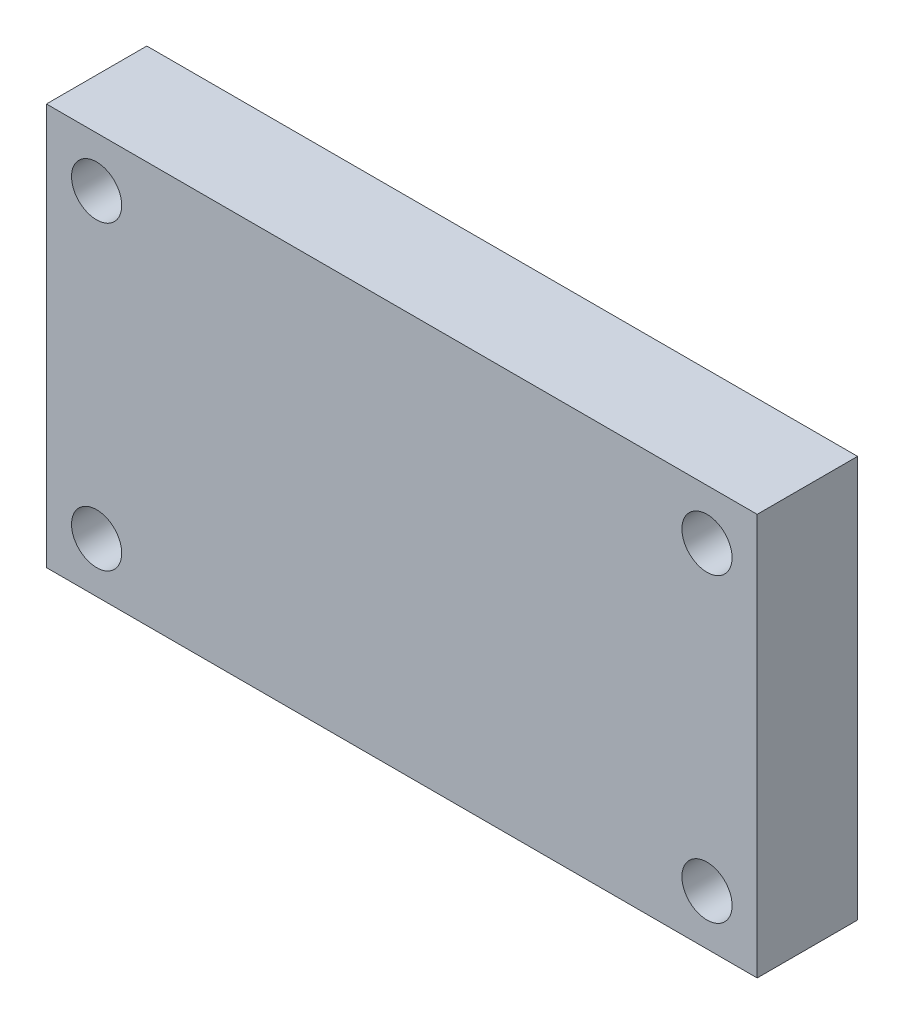
ISO-10303-21;
HEADER;
FILE_DESCRIPTION(('STEP AP214'),'2;1');
FILE_NAME('part.step','',(''),(''),'','','');
FILE_SCHEMA(('AUTOMOTIVE_DESIGN { 1 0 10303 214 1 1 1 1 }'));
ENDSEC;
DATA;
#1=APPLICATION_CONTEXT('core data for automotive mechanical design processes');
#2=APPLICATION_PROTOCOL_DEFINITION('international standard','automotive_design',2000,#1);
#3=PRODUCT_CONTEXT('',#1,'mechanical');
#4=PRODUCT('Part','Part','',(#3));
#5=PRODUCT_RELATED_PRODUCT_CATEGORY('part','',(#4));
#6=PRODUCT_DEFINITION_FORMATION('','',#4);
#7=PRODUCT_DEFINITION_CONTEXT('part definition',#1,'design');
#8=PRODUCT_DEFINITION('design','',#6,#7);
#9=PRODUCT_DEFINITION_SHAPE('','',#8);
#10=(LENGTH_UNIT() NAMED_UNIT(*) SI_UNIT(.MILLI.,.METRE.));
#11=(NAMED_UNIT(*) PLANE_ANGLE_UNIT() SI_UNIT($,.RADIAN.));
#12=(NAMED_UNIT(*) SI_UNIT($,.STERADIAN.) SOLID_ANGLE_UNIT());
#13=UNCERTAINTY_MEASURE_WITH_UNIT(LENGTH_MEASURE(1.E-05),#10,'distance_accuracy_value','');
#14=(GEOMETRIC_REPRESENTATION_CONTEXT(3) GLOBAL_UNCERTAINTY_ASSIGNED_CONTEXT((#13)) GLOBAL_UNIT_ASSIGNED_CONTEXT((#10,
#11,#12)) REPRESENTATION_CONTEXT('',''));
#15=CARTESIAN_POINT('',(0.,0.,0.));
#16=DIRECTION('',(0.,0.,1.));
#17=DIRECTION('',(1.,0.,0.));
#18=AXIS2_PLACEMENT_3D('',#15,#16,#17);
#19=CARTESIAN_POINT('',(0.,-20.,5.));
#20=DIRECTION('',(0.,1.,0.));
#21=DIRECTION('',(0.,0.,1.));
#22=AXIS2_PLACEMENT_3D('',#19,#20,#21);
#23=PLANE('',#22);
#24=DIRECTION('',(1.,0.,0.));
#25=VECTOR('',#24,1.);
#26=CARTESIAN_POINT('',(0.,-20.,0.));
#27=LINE('',#26,#25);
#28=CARTESIAN_POINT('',(0.,-20.,0.));
#29=VERTEX_POINT('',#28);
#30=CARTESIAN_POINT('',(35.4,-20.,0.));
#31=VERTEX_POINT('',#30);
#32=EDGE_CURVE('E108',#29,#31,#27,.T.);
#33=ORIENTED_EDGE('',*,*,#32,.T.);
#34=DIRECTION('',(0.,0.,-1.));
#35=VECTOR('',#34,1.);
#36=CARTESIAN_POINT('',(35.4,-20.,5.));
#37=LINE('',#36,#35);
#38=CARTESIAN_POINT('',(35.4,-20.,5.));
#39=VERTEX_POINT('',#38);
#40=EDGE_CURVE('E11',#39,#31,#37,.T.);
#41=ORIENTED_EDGE('',*,*,#40,.F.);
#42=DIRECTION('',(1.,0.,0.));
#43=VECTOR('',#42,1.);
#44=CARTESIAN_POINT('',(0.,-20.,5.));
#45=LINE('',#44,#43);
#46=CARTESIAN_POINT('',(0.,-20.,5.));
#47=VERTEX_POINT('',#46);
#48=EDGE_CURVE('E72',#47,#39,#45,.T.);
#49=ORIENTED_EDGE('',*,*,#48,.F.);
#50=DIRECTION('',(0.,0.,-1.));
#51=VECTOR('',#50,1.);
#52=CARTESIAN_POINT('',(0.,-20.,5.));
#53=LINE('',#52,#51);
#54=EDGE_CURVE('E107',#47,#29,#53,.T.);
#55=ORIENTED_EDGE('',*,*,#54,.T.);
#56=EDGE_LOOP('',(#33,#41,#49,#55));
#57=FACE_BOUND('',#56,.T.);
#58=ADVANCED_FACE('F33',(#57),#23,.F.);
#59=CARTESIAN_POINT('',(35.4,0.,5.));
#60=DIRECTION('',(1.,0.,0.));
#61=DIRECTION('',(0.,0.,-1.));
#62=AXIS2_PLACEMENT_3D('',#59,#60,#61);
#63=PLANE('',#62);
#64=DIRECTION('',(0.,-1.,0.));
#65=VECTOR('',#64,1.);
#66=CARTESIAN_POINT('',(35.4,0.,0.));
#67=LINE('',#66,#65);
#68=CARTESIAN_POINT('',(35.4,0.,0.));
#69=VERTEX_POINT('',#68);
#70=EDGE_CURVE('E81',#69,#31,#67,.T.);
#71=ORIENTED_EDGE('',*,*,#70,.F.);
#72=DIRECTION('',(0.,0.,-1.));
#73=VECTOR('',#72,1.);
#74=CARTESIAN_POINT('',(35.4,0.,5.));
#75=LINE('',#74,#73);
#76=CARTESIAN_POINT('',(35.4,0.,5.));
#77=VERTEX_POINT('',#76);
#78=EDGE_CURVE('E41',#77,#69,#75,.T.);
#79=ORIENTED_EDGE('',*,*,#78,.F.);
#80=DIRECTION('',(0.,-1.,0.));
#81=VECTOR('',#80,1.);
#82=CARTESIAN_POINT('',(35.4,0.,5.));
#83=LINE('',#82,#81);
#84=EDGE_CURVE('E79',#77,#39,#83,.T.);
#85=ORIENTED_EDGE('',*,*,#84,.T.);
#86=ORIENTED_EDGE('',*,*,#40,.T.);
#87=EDGE_LOOP('',(#71,#79,#85,#86));
#88=FACE_BOUND('',#87,.T.);
#89=ADVANCED_FACE('F78',(#88),#63,.T.);
#90=CARTESIAN_POINT('',(0.,0.,5.));
#91=DIRECTION('',(0.,1.,0.));
#92=DIRECTION('',(0.,0.,1.));
#93=AXIS2_PLACEMENT_3D('',#90,#91,#92);
#94=PLANE('',#93);
#95=DIRECTION('',(1.,0.,0.));
#96=VECTOR('',#95,1.);
#97=CARTESIAN_POINT('',(0.,0.,0.));
#98=LINE('',#97,#96);
#99=CARTESIAN_POINT('',(0.,0.,0.));
#100=VERTEX_POINT('',#99);
#101=EDGE_CURVE('E112',#100,#69,#98,.T.);
#102=ORIENTED_EDGE('',*,*,#101,.F.);
#103=DIRECTION('',(0.,0.,-1.));
#104=VECTOR('',#103,1.);
#105=CARTESIAN_POINT('',(0.,0.,5.));
#106=LINE('',#105,#104);
#107=CARTESIAN_POINT('',(0.,0.,5.));
#108=VERTEX_POINT('',#107);
#109=EDGE_CURVE('E64',#108,#100,#106,.T.);
#110=ORIENTED_EDGE('',*,*,#109,.F.);
#111=DIRECTION('',(1.,0.,0.));
#112=VECTOR('',#111,1.);
#113=CARTESIAN_POINT('',(0.,0.,5.));
#114=LINE('',#113,#112);
#115=EDGE_CURVE('E88',#108,#77,#114,.T.);
#116=ORIENTED_EDGE('',*,*,#115,.T.);
#117=ORIENTED_EDGE('',*,*,#78,.T.);
#118=EDGE_LOOP('',(#102,#110,#116,#117));
#119=FACE_BOUND('',#118,.T.);
#120=ADVANCED_FACE('F90',(#119),#94,.T.);
#121=CARTESIAN_POINT('',(32.9,-2.5,5.));
#122=DIRECTION('',(0.,0.,-1.));
#123=DIRECTION('',(-1.,0.,0.));
#124=AXIS2_PLACEMENT_3D('',#121,#122,#123);
#125=CYLINDRICAL_SURFACE('',#124,1.25);
#126=CARTESIAN_POINT('',(32.9,-2.5,5.));
#127=DIRECTION('',(0.,0.,1.));
#128=DIRECTION('',(1.,0.,0.));
#129=AXIS2_PLACEMENT_3D('',#126,#127,#128);
#130=CIRCLE('',#129,1.25);
#131=CARTESIAN_POINT('',(34.15,-2.5,5.));
#132=VERTEX_POINT('',#131);
#133=EDGE_CURVE('E101',#132,#132,#130,.T.);
#134=ORIENTED_EDGE('',*,*,#133,.T.);
#135=EDGE_LOOP('',(#134));
#136=FACE_BOUND('',#135,.T.);
#137=CARTESIAN_POINT('',(32.9,-2.5,0.));
#138=DIRECTION('',(0.,0.,1.));
#139=DIRECTION('',(1.,0.,0.));
#140=AXIS2_PLACEMENT_3D('',#137,#138,#139);
#141=CIRCLE('',#140,1.25);
#142=CARTESIAN_POINT('',(34.15,-2.5,0.));
#143=VERTEX_POINT('',#142);
#144=EDGE_CURVE('E121',#143,#143,#141,.T.);
#145=ORIENTED_EDGE('',*,*,#144,.F.);
#146=EDGE_LOOP('',(#145));
#147=FACE_BOUND('',#146,.T.);
#148=ADVANCED_FACE('F163',(#136,#147),#125,.F.);
#149=CARTESIAN_POINT('',(2.5,-2.5,5.));
#150=DIRECTION('',(0.,0.,-1.));
#151=DIRECTION('',(-1.,0.,0.));
#152=AXIS2_PLACEMENT_3D('',#149,#150,#151);
#153=CYLINDRICAL_SURFACE('',#152,1.25);
#154=CARTESIAN_POINT('',(2.5,-2.5,5.));
#155=DIRECTION('',(0.,0.,1.));
#156=DIRECTION('',(1.,0.,0.));
#157=AXIS2_PLACEMENT_3D('',#154,#155,#156);
#158=CIRCLE('',#157,1.25);
#159=CARTESIAN_POINT('',(3.75,-2.5,5.));
#160=VERTEX_POINT('',#159);
#161=EDGE_CURVE('E98',#160,#160,#158,.T.);
#162=ORIENTED_EDGE('',*,*,#161,.T.);
#163=EDGE_LOOP('',(#162));
#164=FACE_BOUND('',#163,.T.);
#165=CARTESIAN_POINT('',(2.5,-2.5,0.));
#166=DIRECTION('',(0.,0.,1.));
#167=DIRECTION('',(1.,0.,0.));
#168=AXIS2_PLACEMENT_3D('',#165,#166,#167);
#169=CIRCLE('',#168,1.25);
#170=CARTESIAN_POINT('',(3.75,-2.5,0.));
#171=VERTEX_POINT('',#170);
#172=EDGE_CURVE('E118',#171,#171,#169,.T.);
#173=ORIENTED_EDGE('',*,*,#172,.F.);
#174=EDGE_LOOP('',(#173));
#175=FACE_BOUND('',#174,.T.);
#176=ADVANCED_FACE('F168',(#164,#175),#153,.F.);
#177=CARTESIAN_POINT('',(2.5,-17.5,5.));
#178=DIRECTION('',(0.,0.,-1.));
#179=DIRECTION('',(-1.,0.,0.));
#180=AXIS2_PLACEMENT_3D('',#177,#178,#179);
#181=CYLINDRICAL_SURFACE('',#180,1.25);
#182=CARTESIAN_POINT('',(2.5,-17.5,5.));
#183=DIRECTION('',(0.,0.,1.));
#184=DIRECTION('',(1.,0.,0.));
#185=AXIS2_PLACEMENT_3D('',#182,#183,#184);
#186=CIRCLE('',#185,1.25);
#187=CARTESIAN_POINT('',(3.75,-17.5,5.));
#188=VERTEX_POINT('',#187);
#189=EDGE_CURVE('E92',#188,#188,#186,.T.);
#190=ORIENTED_EDGE('',*,*,#189,.T.);
#191=EDGE_LOOP('',(#190));
#192=FACE_BOUND('',#191,.T.);
#193=CARTESIAN_POINT('',(2.5,-17.5,0.));
#194=DIRECTION('',(0.,0.,1.));
#195=DIRECTION('',(1.,0.,0.));
#196=AXIS2_PLACEMENT_3D('',#193,#194,#195);
#197=CIRCLE('',#196,1.25);
#198=CARTESIAN_POINT('',(3.75,-17.5,0.));
#199=VERTEX_POINT('',#198);
#200=EDGE_CURVE('E115',#199,#199,#197,.T.);
#201=ORIENTED_EDGE('',*,*,#200,.F.);
#202=EDGE_LOOP('',(#201));
#203=FACE_BOUND('',#202,.T.);
#204=ADVANCED_FACE('F153',(#192,#203),#181,.F.);
#205=CARTESIAN_POINT('',(0.,0.,5.));
#206=DIRECTION('',(1.,0.,0.));
#207=DIRECTION('',(0.,1.,0.));
#208=AXIS2_PLACEMENT_3D('',#205,#206,#207);
#209=PLANE('',#208);
#210=DIRECTION('',(0.,-1.,0.));
#211=VECTOR('',#210,1.);
#212=CARTESIAN_POINT('',(0.,0.,0.));
#213=LINE('',#212,#211);
#214=EDGE_CURVE('E67',#100,#29,#213,.T.);
#215=ORIENTED_EDGE('',*,*,#214,.T.);
#216=ORIENTED_EDGE('',*,*,#54,.F.);
#217=DIRECTION('',(0.,-1.,0.));
#218=VECTOR('',#217,1.);
#219=CARTESIAN_POINT('',(0.,0.,5.));
#220=LINE('',#219,#218);
#221=EDGE_CURVE('E49',#108,#47,#220,.T.);
#222=ORIENTED_EDGE('',*,*,#221,.F.);
#223=ORIENTED_EDGE('',*,*,#109,.T.);
#224=EDGE_LOOP('',(#215,#216,#222,#223));
#225=FACE_BOUND('',#224,.T.);
#226=ADVANCED_FACE('F145',(#225),#209,.F.);
#227=CARTESIAN_POINT('',(32.9,-17.5,5.));
#228=DIRECTION('',(0.,0.,-1.));
#229=DIRECTION('',(-1.,0.,0.));
#230=AXIS2_PLACEMENT_3D('',#227,#228,#229);
#231=CYLINDRICAL_SURFACE('',#230,1.25);
#232=CARTESIAN_POINT('',(32.9,-17.5,5.));
#233=DIRECTION('',(0.,0.,1.));
#234=DIRECTION('',(1.,0.,0.));
#235=AXIS2_PLACEMENT_3D('',#232,#233,#234);
#236=CIRCLE('',#235,1.25);
#237=CARTESIAN_POINT('',(34.15,-17.5,5.));
#238=VERTEX_POINT('',#237);
#239=EDGE_CURVE('E104',#238,#238,#236,.T.);
#240=ORIENTED_EDGE('',*,*,#239,.T.);
#241=EDGE_LOOP('',(#240));
#242=FACE_BOUND('',#241,.T.);
#243=CARTESIAN_POINT('',(32.9,-17.5,0.));
#244=DIRECTION('',(0.,0.,1.));
#245=DIRECTION('',(1.,0.,0.));
#246=AXIS2_PLACEMENT_3D('',#243,#244,#245);
#247=CIRCLE('',#246,1.25);
#248=CARTESIAN_POINT('',(34.15,-17.5,0.));
#249=VERTEX_POINT('',#248);
#250=EDGE_CURVE('E124',#249,#249,#247,.T.);
#251=ORIENTED_EDGE('',*,*,#250,.F.);
#252=EDGE_LOOP('',(#251));
#253=FACE_BOUND('',#252,.T.);
#254=ADVANCED_FACE('F143',(#242,#253),#231,.F.);
#255=CARTESIAN_POINT('',(0.,0.,5.));
#256=DIRECTION('',(0.,0.,1.));
#257=DIRECTION('',(1.,0.,0.));
#258=AXIS2_PLACEMENT_3D('',#255,#256,#257);
#259=PLANE('',#258);
#260=ORIENTED_EDGE('',*,*,#48,.T.);
#261=ORIENTED_EDGE('',*,*,#84,.F.);
#262=ORIENTED_EDGE('',*,*,#115,.F.);
#263=ORIENTED_EDGE('',*,*,#221,.T.);
#264=EDGE_LOOP('',(#260,#261,#262,#263));
#265=FACE_BOUND('',#264,.T.);
#266=ORIENTED_EDGE('',*,*,#189,.F.);
#267=EDGE_LOOP('',(#266));
#268=FACE_BOUND('',#267,.T.);
#269=ORIENTED_EDGE('',*,*,#161,.F.);
#270=EDGE_LOOP('',(#269));
#271=FACE_BOUND('',#270,.T.);
#272=ORIENTED_EDGE('',*,*,#133,.F.);
#273=EDGE_LOOP('',(#272));
#274=FACE_BOUND('',#273,.T.);
#275=ORIENTED_EDGE('',*,*,#239,.F.);
#276=EDGE_LOOP('',(#275));
#277=FACE_BOUND('',#276,.T.);
#278=ADVANCED_FACE('F86',(#265,#268,#271,#274,#277),#259,.T.);
#279=CARTESIAN_POINT('',(0.,0.,0.));
#280=DIRECTION('',(0.,0.,1.));
#281=DIRECTION('',(1.,0.,0.));
#282=AXIS2_PLACEMENT_3D('',#279,#280,#281);
#283=PLANE('',#282);
#284=ORIENTED_EDGE('',*,*,#32,.F.);
#285=ORIENTED_EDGE('',*,*,#214,.F.);
#286=ORIENTED_EDGE('',*,*,#101,.T.);
#287=ORIENTED_EDGE('',*,*,#70,.T.);
#288=EDGE_LOOP('',(#284,#285,#286,#287));
#289=FACE_BOUND('',#288,.T.);
#290=ORIENTED_EDGE('',*,*,#200,.T.);
#291=EDGE_LOOP('',(#290));
#292=FACE_BOUND('',#291,.T.);
#293=ORIENTED_EDGE('',*,*,#172,.T.);
#294=EDGE_LOOP('',(#293));
#295=FACE_BOUND('',#294,.T.);
#296=ORIENTED_EDGE('',*,*,#144,.T.);
#297=EDGE_LOOP('',(#296));
#298=FACE_BOUND('',#297,.T.);
#299=ORIENTED_EDGE('',*,*,#250,.T.);
#300=EDGE_LOOP('',(#299));
#301=FACE_BOUND('',#300,.T.);
#302=ADVANCED_FACE('F131',(#289,#292,#295,#298,#301),#283,.F.);
#303=CLOSED_SHELL('',(#58,#89,#120,#148,#176,#204,#226,#254,#278,#302));
#304=MANIFOLD_SOLID_BREP('B2',#303);
#305=ADVANCED_BREP_SHAPE_REPRESENTATION('',(#18,#304),#14);
#306=SHAPE_DEFINITION_REPRESENTATION(#9,#305);
ENDSEC;
END-ISO-10303-21;
